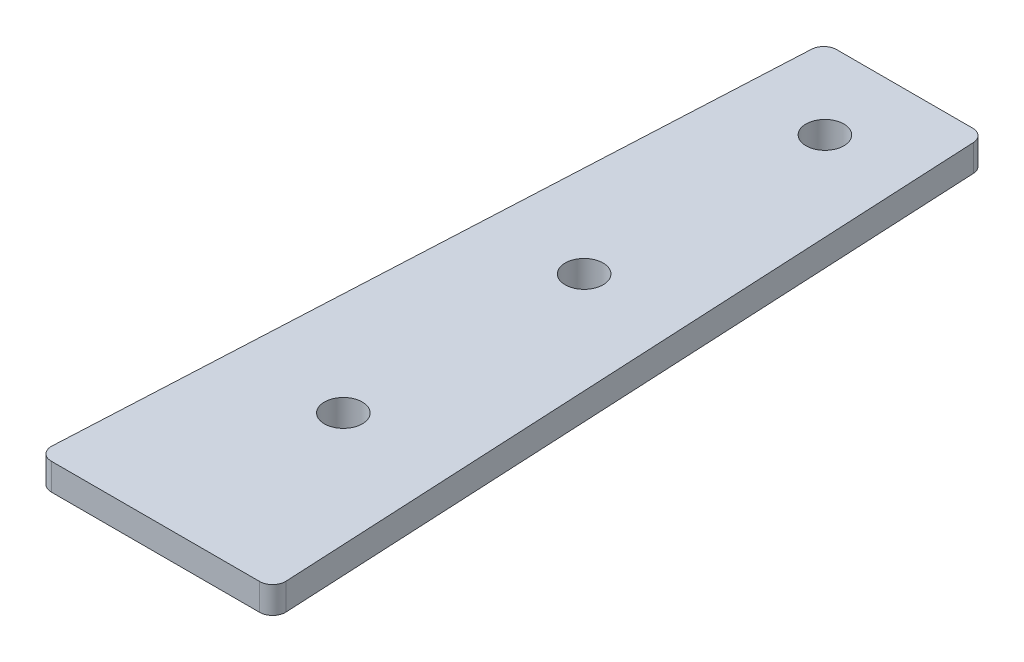
ISO-10303-21;
HEADER;
FILE_DESCRIPTION(('STEP AP214'),'2;1');
FILE_NAME('part.step','',(''),(''),'','','');
FILE_SCHEMA(('AUTOMOTIVE_DESIGN { 1 0 10303 214 1 1 1 1 }'));
ENDSEC;
DATA;
#1=APPLICATION_CONTEXT('core data for automotive mechanical design processes');
#2=APPLICATION_PROTOCOL_DEFINITION('international standard','automotive_design',2000,#1);
#3=PRODUCT_CONTEXT('',#1,'mechanical');
#4=PRODUCT('Part','Part','',(#3));
#5=PRODUCT_RELATED_PRODUCT_CATEGORY('part','',(#4));
#6=PRODUCT_DEFINITION_FORMATION('','',#4);
#7=PRODUCT_DEFINITION_CONTEXT('part definition',#1,'design');
#8=PRODUCT_DEFINITION('design','',#6,#7);
#9=PRODUCT_DEFINITION_SHAPE('','',#8);
#10=(LENGTH_UNIT() NAMED_UNIT(*) SI_UNIT(.MILLI.,.METRE.));
#11=(NAMED_UNIT(*) PLANE_ANGLE_UNIT() SI_UNIT($,.RADIAN.));
#12=(NAMED_UNIT(*) SI_UNIT($,.STERADIAN.) SOLID_ANGLE_UNIT());
#13=UNCERTAINTY_MEASURE_WITH_UNIT(LENGTH_MEASURE(1.E-05),#10,'distance_accuracy_value','');
#14=(GEOMETRIC_REPRESENTATION_CONTEXT(3) GLOBAL_UNCERTAINTY_ASSIGNED_CONTEXT((#13)) GLOBAL_UNIT_ASSIGNED_CONTEXT((#10,
#11,#12)) REPRESENTATION_CONTEXT('',''));
#15=CARTESIAN_POINT('',(0.,0.,0.));
#16=DIRECTION('',(0.,0.,1.));
#17=DIRECTION('',(1.,0.,0.));
#18=AXIS2_PLACEMENT_3D('',#15,#16,#17);
#19=CARTESIAN_POINT('',(-83.3952961891391,3.175,-36.5110000029994));
#20=DIRECTION('',(0.,-1.,0.));
#21=DIRECTION('',(0.,0.,-1.));
#22=AXIS2_PLACEMENT_3D('',#19,#20,#21);
#23=CYLINDRICAL_SURFACE('',#22,1.524);
#24=CARTESIAN_POINT('',(-83.3952961891391,0.,-36.5110000029994));
#25=DIRECTION('',(0.,1.,0.));
#26=DIRECTION('',(0.,0.,1.));
#27=AXIS2_PLACEMENT_3D('',#24,#25,#26);
#28=CIRCLE('',#27,1.524);
#29=CARTESIAN_POINT('',(-83.3952961891385,0.,-38.0350000029994));
#30=VERTEX_POINT('',#29);
#31=CARTESIAN_POINT('',(-84.917394753589,0.,-36.5871049312219));
#32=VERTEX_POINT('',#31);
#33=EDGE_CURVE('E139',#30,#32,#28,.T.);
#34=ORIENTED_EDGE('',*,*,#33,.T.);
#35=DIRECTION('',(0.,-1.,0.));
#36=VECTOR('',#35,1.);
#37=CARTESIAN_POINT('',(-84.917394753589,3.175,-36.5871049312219));
#38=LINE('',#37,#36);
#39=CARTESIAN_POINT('',(-84.917394753589,3.175,-36.5871049312219));
#40=VERTEX_POINT('',#39);
#41=EDGE_CURVE('E47',#40,#32,#38,.T.);
#42=ORIENTED_EDGE('',*,*,#41,.F.);
#43=CARTESIAN_POINT('',(-83.3952961891391,3.175,-36.5110000029994));
#44=DIRECTION('',(0.,1.,0.));
#45=DIRECTION('',(0.,0.,1.));
#46=AXIS2_PLACEMENT_3D('',#43,#44,#45);
#47=CIRCLE('',#46,1.524);
#48=CARTESIAN_POINT('',(-83.3952961891385,3.175,-38.0350000029994));
#49=VERTEX_POINT('',#48);
#50=EDGE_CURVE('E99',#49,#40,#47,.T.);
#51=ORIENTED_EDGE('',*,*,#50,.F.);
#52=DIRECTION('',(0.,-1.,0.));
#53=VECTOR('',#52,1.);
#54=CARTESIAN_POINT('',(-83.3952961891385,3.175,-38.0350000029994));
#55=LINE('',#54,#53);
#56=EDGE_CURVE('E11',#49,#30,#55,.T.);
#57=ORIENTED_EDGE('',*,*,#56,.T.);
#58=EDGE_LOOP('',(#34,#42,#51,#57));
#59=FACE_BOUND('',#58,.T.);
#60=ADVANCED_FACE('F39',(#59),#23,.T.);
#61=CARTESIAN_POINT('',(-84.917394753589,3.175,-36.5871049312219));
#62=DIRECTION('',(0.998752338877845,0.,0.0499376169438922));
#63=DIRECTION('',(0.0499376169438922,0.,-0.998752338877845));
#64=AXIS2_PLACEMENT_3D('',#61,#62,#63);
#65=PLANE('',#64);
#66=DIRECTION('',(-0.0499376169438922,0.,0.998752338877845));
#67=VECTOR('',#66,1.);
#68=CARTESIAN_POINT('',(-84.917394753589,0.,-36.5871049312219));
#69=LINE('',#68,#67);
#70=CARTESIAN_POINT('',(-89.2099947535889,0.,49.2648950687775));
#71=VERTEX_POINT('',#70);
#72=EDGE_CURVE('E141',#32,#71,#69,.T.);
#73=ORIENTED_EDGE('',*,*,#72,.T.);
#74=DIRECTION('',(0.,-1.,0.));
#75=VECTOR('',#74,1.);
#76=CARTESIAN_POINT('',(-89.2099947535889,3.175,49.2648950687775));
#77=LINE('',#76,#75);
#78=CARTESIAN_POINT('',(-89.2099947535889,3.175,49.2648950687775));
#79=VERTEX_POINT('',#78);
#80=EDGE_CURVE('E160',#79,#71,#77,.T.);
#81=ORIENTED_EDGE('',*,*,#80,.F.);
#82=DIRECTION('',(-0.0499376169438922,0.,0.998752338877845));
#83=VECTOR('',#82,1.);
#84=CARTESIAN_POINT('',(-84.917394753589,3.175,-36.5871049312219));
#85=LINE('',#84,#83);
#86=EDGE_CURVE('E168',#40,#79,#85,.T.);
#87=ORIENTED_EDGE('',*,*,#86,.F.);
#88=ORIENTED_EDGE('',*,*,#41,.T.);
#89=EDGE_LOOP('',(#73,#81,#87,#88));
#90=FACE_BOUND('',#89,.T.);
#91=ADVANCED_FACE('F166',(#90),#65,.F.);
#92=CARTESIAN_POINT('',(-87.6878961891391,3.175,49.340999997));
#93=DIRECTION('',(0.,-1.,0.));
#94=DIRECTION('',(0.,0.,-1.));
#95=AXIS2_PLACEMENT_3D('',#92,#93,#94);
#96=CYLINDRICAL_SURFACE('',#95,1.524);
#97=CARTESIAN_POINT('',(-87.6878961891391,0.,49.340999997));
#98=DIRECTION('',(0.,1.,0.));
#99=DIRECTION('',(0.,0.,-1.));
#100=AXIS2_PLACEMENT_3D('',#97,#98,#99);
#101=CIRCLE('',#100,1.524);
#102=CARTESIAN_POINT('',(-87.6878961891391,0.,50.864999997));
#103=VERTEX_POINT('',#102);
#104=EDGE_CURVE('E144',#71,#103,#101,.T.);
#105=ORIENTED_EDGE('',*,*,#104,.T.);
#106=DIRECTION('',(0.,-1.,0.));
#107=VECTOR('',#106,1.);
#108=CARTESIAN_POINT('',(-87.6878961891391,3.175,50.864999997));
#109=LINE('',#108,#107);
#110=CARTESIAN_POINT('',(-87.6878961891391,3.175,50.864999997));
#111=VERTEX_POINT('',#110);
#112=EDGE_CURVE('E157',#111,#103,#109,.T.);
#113=ORIENTED_EDGE('',*,*,#112,.F.);
#114=CARTESIAN_POINT('',(-87.6878961891391,3.175,49.340999997));
#115=DIRECTION('',(0.,1.,0.));
#116=DIRECTION('',(0.,0.,-1.));
#117=AXIS2_PLACEMENT_3D('',#114,#115,#116);
#118=CIRCLE('',#117,1.524);
#119=EDGE_CURVE('E180',#79,#111,#118,.T.);
#120=ORIENTED_EDGE('',*,*,#119,.F.);
#121=ORIENTED_EDGE('',*,*,#80,.T.);
#122=EDGE_LOOP('',(#105,#113,#120,#121));
#123=FACE_BOUND('',#122,.T.);
#124=ADVANCED_FACE('F176',(#123),#96,.T.);
#125=CARTESIAN_POINT('',(-75.3200000000001,3.175,50.864999997));
#126=DIRECTION('',(0.,0.,-1.));
#127=DIRECTION('',(-1.,0.,0.));
#128=AXIS2_PLACEMENT_3D('',#125,#126,#127);
#129=PLANE('',#128);
#130=DIRECTION('',(1.,0.,0.));
#131=VECTOR('',#130,1.);
#132=CARTESIAN_POINT('',(-75.3200000000001,0.,50.864999997));
#133=LINE('',#132,#131);
#134=CARTESIAN_POINT('',(-62.952103810861,0.,50.864999997));
#135=VERTEX_POINT('',#134);
#136=EDGE_CURVE('E147',#103,#135,#133,.T.);
#137=ORIENTED_EDGE('',*,*,#136,.T.);
#138=DIRECTION('',(0.,-1.,0.));
#139=VECTOR('',#138,1.);
#140=CARTESIAN_POINT('',(-62.952103810861,3.175,50.864999997));
#141=LINE('',#140,#139);
#142=CARTESIAN_POINT('',(-62.952103810861,3.175,50.864999997));
#143=VERTEX_POINT('',#142);
#144=EDGE_CURVE('E128',#143,#135,#141,.T.);
#145=ORIENTED_EDGE('',*,*,#144,.F.);
#146=DIRECTION('',(1.,0.,0.));
#147=VECTOR('',#146,1.);
#148=CARTESIAN_POINT('',(-75.3200000000001,3.175,50.864999997));
#149=LINE('',#148,#147);
#150=EDGE_CURVE('E119',#111,#143,#149,.T.);
#151=ORIENTED_EDGE('',*,*,#150,.F.);
#152=ORIENTED_EDGE('',*,*,#112,.T.);
#153=EDGE_LOOP('',(#137,#145,#151,#152));
#154=FACE_BOUND('',#153,.T.);
#155=ADVANCED_FACE('F179',(#154),#129,.F.);
#156=CARTESIAN_POINT('',(-62.952103810861,3.175,49.340999997));
#157=DIRECTION('',(0.,-1.,0.));
#158=DIRECTION('',(0.,0.,-1.));
#159=AXIS2_PLACEMENT_3D('',#156,#157,#158);
#160=CYLINDRICAL_SURFACE('',#159,1.524);
#161=CARTESIAN_POINT('',(-62.952103810861,0.,49.340999997));
#162=DIRECTION('',(0.,1.,0.));
#163=DIRECTION('',(0.,0.,1.));
#164=AXIS2_PLACEMENT_3D('',#161,#162,#163);
#165=CIRCLE('',#164,1.524);
#166=CARTESIAN_POINT('',(-61.4300052464112,0.,49.2648950687775));
#167=VERTEX_POINT('',#166);
#168=EDGE_CURVE('E127',#135,#167,#165,.T.);
#169=ORIENTED_EDGE('',*,*,#168,.T.);
#170=DIRECTION('',(0.,-1.,0.));
#171=VECTOR('',#170,1.);
#172=CARTESIAN_POINT('',(-61.4300052464112,3.175,49.2648950687775));
#173=LINE('',#172,#171);
#174=CARTESIAN_POINT('',(-61.4300052464112,3.175,49.2648950687775));
#175=VERTEX_POINT('',#174);
#176=EDGE_CURVE('E124',#175,#167,#173,.T.);
#177=ORIENTED_EDGE('',*,*,#176,.F.);
#178=CARTESIAN_POINT('',(-62.952103810861,3.175,49.340999997));
#179=DIRECTION('',(0.,1.,0.));
#180=DIRECTION('',(0.,0.,1.));
#181=AXIS2_PLACEMENT_3D('',#178,#179,#180);
#182=CIRCLE('',#181,1.524);
#183=EDGE_CURVE('E113',#143,#175,#182,.T.);
#184=ORIENTED_EDGE('',*,*,#183,.F.);
#185=ORIENTED_EDGE('',*,*,#144,.T.);
#186=EDGE_LOOP('',(#169,#177,#184,#185));
#187=FACE_BOUND('',#186,.T.);
#188=ADVANCED_FACE('F125',(#187),#160,.T.);
#189=CARTESIAN_POINT('',(-65.7226052464111,3.175,-36.5871049312219));
#190=DIRECTION('',(-0.998752338877845,0.,0.0499376169438923));
#191=DIRECTION('',(0.0499376169438923,0.,0.998752338877845));
#192=AXIS2_PLACEMENT_3D('',#189,#190,#191);
#193=PLANE('',#192);
#194=DIRECTION('',(-0.0499376169438923,0.,-0.998752338877845));
#195=VECTOR('',#194,1.);
#196=CARTESIAN_POINT('',(-65.7226052464111,0.,-36.5871049312219));
#197=LINE('',#196,#195);
#198=CARTESIAN_POINT('',(-65.7226052464111,0.,-36.5871049312219));
#199=VERTEX_POINT('',#198);
#200=EDGE_CURVE('E85',#167,#199,#197,.T.);
#201=ORIENTED_EDGE('',*,*,#200,.T.);
#202=DIRECTION('',(0.,-1.,0.));
#203=VECTOR('',#202,1.);
#204=CARTESIAN_POINT('',(-65.7226052464111,3.175,-36.5871049312219));
#205=LINE('',#204,#203);
#206=CARTESIAN_POINT('',(-65.7226052464111,3.175,-36.5871049312219));
#207=VERTEX_POINT('',#206);
#208=EDGE_CURVE('E129',#207,#199,#205,.T.);
#209=ORIENTED_EDGE('',*,*,#208,.F.);
#210=DIRECTION('',(-0.0499376169438923,0.,-0.998752338877845));
#211=VECTOR('',#210,1.);
#212=CARTESIAN_POINT('',(-65.7226052464111,3.175,-36.5871049312219));
#213=LINE('',#212,#211);
#214=EDGE_CURVE('E117',#175,#207,#213,.T.);
#215=ORIENTED_EDGE('',*,*,#214,.F.);
#216=ORIENTED_EDGE('',*,*,#176,.T.);
#217=EDGE_LOOP('',(#201,#209,#215,#216));
#218=FACE_BOUND('',#217,.T.);
#219=ADVANCED_FACE('F131',(#218),#193,.F.);
#220=CARTESIAN_POINT('',(-67.244703810861,3.175,-36.5110000029994));
#221=DIRECTION('',(0.,-1.,0.));
#222=DIRECTION('',(0.,0.,-1.));
#223=AXIS2_PLACEMENT_3D('',#220,#221,#222);
#224=CYLINDRICAL_SURFACE('',#223,1.524);
#225=CARTESIAN_POINT('',(-67.244703810861,0.,-36.5110000029994));
#226=DIRECTION('',(0.,1.,0.));
#227=DIRECTION('',(0.,0.,-1.));
#228=AXIS2_PLACEMENT_3D('',#225,#226,#227);
#229=CIRCLE('',#228,1.524);
#230=CARTESIAN_POINT('',(-67.2447038108616,0.,-38.0350000029994));
#231=VERTEX_POINT('',#230);
#232=EDGE_CURVE('E92',#199,#231,#229,.T.);
#233=ORIENTED_EDGE('',*,*,#232,.T.);
#234=DIRECTION('',(0.,-1.,0.));
#235=VECTOR('',#234,1.);
#236=CARTESIAN_POINT('',(-67.2447038108616,3.175,-38.0350000029994));
#237=LINE('',#236,#235);
#238=CARTESIAN_POINT('',(-67.2447038108616,3.175,-38.0350000029994));
#239=VERTEX_POINT('',#238);
#240=EDGE_CURVE('E135',#239,#231,#237,.T.);
#241=ORIENTED_EDGE('',*,*,#240,.F.);
#242=CARTESIAN_POINT('',(-67.244703810861,3.175,-36.5110000029994));
#243=DIRECTION('',(0.,1.,0.));
#244=DIRECTION('',(0.,0.,-1.));
#245=AXIS2_PLACEMENT_3D('',#242,#243,#244);
#246=CIRCLE('',#245,1.524);
#247=EDGE_CURVE('E133',#207,#239,#246,.T.);
#248=ORIENTED_EDGE('',*,*,#247,.F.);
#249=ORIENTED_EDGE('',*,*,#208,.T.);
#250=EDGE_LOOP('',(#233,#241,#248,#249));
#251=FACE_BOUND('',#250,.T.);
#252=ADVANCED_FACE('F232',(#251),#224,.T.);
#253=CARTESIAN_POINT('',(-75.32,3.175,-38.035000002996));
#254=DIRECTION('',(4.14170178201244E-13,0.,1.));
#255=DIRECTION('',(1.,0.,-4.14170178201244E-13));
#256=AXIS2_PLACEMENT_3D('',#253,#254,#255);
#257=PLANE('',#256);
#258=DIRECTION('',(-1.,0.,4.14170178201244E-13));
#259=VECTOR('',#258,1.);
#260=CARTESIAN_POINT('',(-75.32,0.,-38.035000002996));
#261=LINE('',#260,#259);
#262=EDGE_CURVE('E152',#231,#30,#261,.T.);
#263=ORIENTED_EDGE('',*,*,#262,.T.);
#264=ORIENTED_EDGE('',*,*,#56,.F.);
#265=DIRECTION('',(-1.,0.,-4.14170178201242E-13));
#266=VECTOR('',#265,1.);
#267=CARTESIAN_POINT('',(-75.32,3.175,-38.035000002996));
#268=LINE('',#267,#266);
#269=EDGE_CURVE('E55',#239,#49,#268,.T.);
#270=ORIENTED_EDGE('',*,*,#269,.F.);
#271=ORIENTED_EDGE('',*,*,#240,.T.);
#272=EDGE_LOOP('',(#263,#264,#270,#271));
#273=FACE_BOUND('',#272,.T.);
#274=ADVANCED_FACE('F208',(#273),#257,.F.);
#275=CARTESIAN_POINT('',(-83.3952961891391,3.175,-36.5110000029994));
#276=DIRECTION('',(0.,1.,0.));
#277=DIRECTION('',(0.,0.,1.));
#278=AXIS2_PLACEMENT_3D('',#275,#276,#277);
#279=PLANE('',#278);
#280=CARTESIAN_POINT('',(-75.3200000000025,3.175,-28.5749999999947));
#281=DIRECTION('',(0.,1.,0.));
#282=DIRECTION('',(0.,0.,1.));
#283=AXIS2_PLACEMENT_3D('',#280,#281,#282);
#284=CIRCLE('',#283,2.24999999999999);
#285=CARTESIAN_POINT('',(-75.3200000000025,3.175,-26.3249999999947));
#286=VERTEX_POINT('',#285);
#287=EDGE_CURVE('E200',#286,#286,#284,.T.);
#288=ORIENTED_EDGE('',*,*,#287,.F.);
#289=EDGE_LOOP('',(#288));
#290=FACE_BOUND('',#289,.T.);
#291=CARTESIAN_POINT('',(-75.3200000000025,3.175,0.));
#292=DIRECTION('',(0.,1.,0.));
#293=DIRECTION('',(0.,0.,1.));
#294=AXIS2_PLACEMENT_3D('',#291,#292,#293);
#295=CIRCLE('',#294,2.24999999999999);
#296=CARTESIAN_POINT('',(-75.3200000000025,3.175,2.24999999999999));
#297=VERTEX_POINT('',#296);
#298=EDGE_CURVE('E194',#297,#297,#295,.T.);
#299=ORIENTED_EDGE('',*,*,#298,.F.);
#300=EDGE_LOOP('',(#299));
#301=FACE_BOUND('',#300,.T.);
#302=CARTESIAN_POINT('',(-75.3200000000025,3.175,28.5749999999947));
#303=DIRECTION('',(0.,1.,0.));
#304=DIRECTION('',(0.,0.,1.));
#305=AXIS2_PLACEMENT_3D('',#302,#303,#304);
#306=CIRCLE('',#305,2.24999999999999);
#307=CARTESIAN_POINT('',(-75.3200000000025,3.175,30.8249999999947));
#308=VERTEX_POINT('',#307);
#309=EDGE_CURVE('E188',#308,#308,#306,.T.);
#310=ORIENTED_EDGE('',*,*,#309,.F.);
#311=EDGE_LOOP('',(#310));
#312=FACE_BOUND('',#311,.T.);
#313=ORIENTED_EDGE('',*,*,#269,.T.);
#314=ORIENTED_EDGE('',*,*,#50,.T.);
#315=ORIENTED_EDGE('',*,*,#86,.T.);
#316=ORIENTED_EDGE('',*,*,#119,.T.);
#317=ORIENTED_EDGE('',*,*,#150,.T.);
#318=ORIENTED_EDGE('',*,*,#183,.T.);
#319=ORIENTED_EDGE('',*,*,#214,.T.);
#320=ORIENTED_EDGE('',*,*,#247,.T.);
#321=EDGE_LOOP('',(#313,#314,#315,#316,#317,#318,#319,#320));
#322=FACE_BOUND('',#321,.T.);
#323=ADVANCED_FACE('F115',(#290,#301,#312,#322),#279,.T.);
#324=CARTESIAN_POINT('',(-83.3952961891391,0.,-36.5110000029994));
#325=DIRECTION('',(0.,1.,0.));
#326=DIRECTION('',(0.,0.,1.));
#327=AXIS2_PLACEMENT_3D('',#324,#325,#326);
#328=PLANE('',#327);
#329=CARTESIAN_POINT('',(-75.3200000000025,0.,-28.5749999999947));
#330=DIRECTION('',(0.,1.,0.));
#331=DIRECTION('',(0.,0.,1.));
#332=AXIS2_PLACEMENT_3D('',#329,#330,#331);
#333=CIRCLE('',#332,2.24999999999999);
#334=CARTESIAN_POINT('',(-75.3200000000025,0.,-26.3249999999947));
#335=VERTEX_POINT('',#334);
#336=EDGE_CURVE('E197',#335,#335,#333,.T.);
#337=ORIENTED_EDGE('',*,*,#336,.T.);
#338=EDGE_LOOP('',(#337));
#339=FACE_BOUND('',#338,.T.);
#340=CARTESIAN_POINT('',(-75.3200000000025,0.,0.));
#341=DIRECTION('',(0.,1.,0.));
#342=DIRECTION('',(0.,0.,1.));
#343=AXIS2_PLACEMENT_3D('',#340,#341,#342);
#344=CIRCLE('',#343,2.24999999999999);
#345=CARTESIAN_POINT('',(-75.3200000000025,0.,2.24999999999999));
#346=VERTEX_POINT('',#345);
#347=EDGE_CURVE('E191',#346,#346,#344,.T.);
#348=ORIENTED_EDGE('',*,*,#347,.T.);
#349=EDGE_LOOP('',(#348));
#350=FACE_BOUND('',#349,.T.);
#351=CARTESIAN_POINT('',(-75.3200000000025,0.,28.5749999999947));
#352=DIRECTION('',(0.,1.,0.));
#353=DIRECTION('',(0.,0.,1.));
#354=AXIS2_PLACEMENT_3D('',#351,#352,#353);
#355=CIRCLE('',#354,2.24999999999999);
#356=CARTESIAN_POINT('',(-75.3200000000025,0.,30.8249999999947));
#357=VERTEX_POINT('',#356);
#358=EDGE_CURVE('E142',#357,#357,#355,.T.);
#359=ORIENTED_EDGE('',*,*,#358,.T.);
#360=EDGE_LOOP('',(#359));
#361=FACE_BOUND('',#360,.T.);
#362=ORIENTED_EDGE('',*,*,#33,.F.);
#363=ORIENTED_EDGE('',*,*,#262,.F.);
#364=ORIENTED_EDGE('',*,*,#232,.F.);
#365=ORIENTED_EDGE('',*,*,#200,.F.);
#366=ORIENTED_EDGE('',*,*,#168,.F.);
#367=ORIENTED_EDGE('',*,*,#136,.F.);
#368=ORIENTED_EDGE('',*,*,#104,.F.);
#369=ORIENTED_EDGE('',*,*,#72,.F.);
#370=EDGE_LOOP('',(#362,#363,#364,#365,#366,#367,#368,#369));
#371=FACE_BOUND('',#370,.T.);
#372=ADVANCED_FACE('F172',(#339,#350,#361,#371),#328,.F.);
#373=CARTESIAN_POINT('',(-75.3200000000025,3.175,28.5749999999947));
#374=DIRECTION('',(0.,1.,0.));
#375=DIRECTION('',(0.,0.,1.));
#376=AXIS2_PLACEMENT_3D('',#373,#374,#375);
#377=CYLINDRICAL_SURFACE('',#376,2.24999999999999);
#378=ORIENTED_EDGE('',*,*,#358,.F.);
#379=EDGE_LOOP('',(#378));
#380=FACE_BOUND('',#379,.T.);
#381=ORIENTED_EDGE('',*,*,#309,.T.);
#382=EDGE_LOOP('',(#381));
#383=FACE_BOUND('',#382,.T.);
#384=ADVANCED_FACE('F214',(#380,#383),#377,.F.);
#385=CARTESIAN_POINT('',(-75.3200000000025,3.175,0.));
#386=DIRECTION('',(0.,1.,0.));
#387=DIRECTION('',(0.,0.,1.));
#388=AXIS2_PLACEMENT_3D('',#385,#386,#387);
#389=CYLINDRICAL_SURFACE('',#388,2.24999999999999);
#390=ORIENTED_EDGE('',*,*,#347,.F.);
#391=EDGE_LOOP('',(#390));
#392=FACE_BOUND('',#391,.T.);
#393=ORIENTED_EDGE('',*,*,#298,.T.);
#394=EDGE_LOOP('',(#393));
#395=FACE_BOUND('',#394,.T.);
#396=ADVANCED_FACE('F216',(#392,#395),#389,.F.);
#397=CARTESIAN_POINT('',(-75.3200000000025,3.175,-28.5749999999947));
#398=DIRECTION('',(0.,1.,0.));
#399=DIRECTION('',(0.,0.,1.));
#400=AXIS2_PLACEMENT_3D('',#397,#398,#399);
#401=CYLINDRICAL_SURFACE('',#400,2.24999999999999);
#402=ORIENTED_EDGE('',*,*,#336,.F.);
#403=EDGE_LOOP('',(#402));
#404=FACE_BOUND('',#403,.T.);
#405=ORIENTED_EDGE('',*,*,#287,.T.);
#406=EDGE_LOOP('',(#405));
#407=FACE_BOUND('',#406,.T.);
#408=ADVANCED_FACE('F204',(#404,#407),#401,.F.);
#409=CLOSED_SHELL('',(#60,#91,#124,#155,#188,#219,#252,#274,#323,#372,#384,#396,#408));
#410=MANIFOLD_SOLID_BREP('B2',#409);
#411=ADVANCED_BREP_SHAPE_REPRESENTATION('',(#18,#410),#14);
#412=SHAPE_DEFINITION_REPRESENTATION(#9,#411);
ENDSEC;
END-ISO-10303-21;
